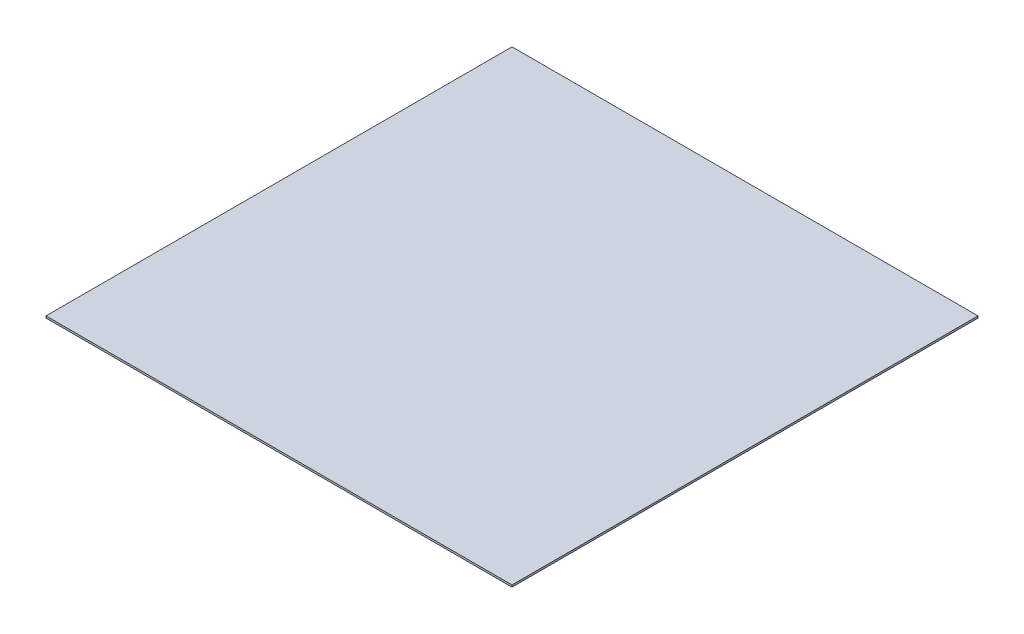
ISO-10303-21;
HEADER;
FILE_DESCRIPTION(('STEP AP214'),'2;1');
FILE_NAME('part.step','',(''),(''),'','','');
FILE_SCHEMA(('AUTOMOTIVE_DESIGN { 1 0 10303 214 1 1 1 1 }'));
ENDSEC;
DATA;
#1=APPLICATION_CONTEXT('core data for automotive mechanical design processes');
#2=APPLICATION_PROTOCOL_DEFINITION('international standard','automotive_design',2000,#1);
#3=PRODUCT_CONTEXT('',#1,'mechanical');
#4=PRODUCT('Part','Part','',(#3));
#5=PRODUCT_RELATED_PRODUCT_CATEGORY('part','',(#4));
#6=PRODUCT_DEFINITION_FORMATION('','',#4);
#7=PRODUCT_DEFINITION_CONTEXT('part definition',#1,'design');
#8=PRODUCT_DEFINITION('design','',#6,#7);
#9=PRODUCT_DEFINITION_SHAPE('','',#8);
#10=(LENGTH_UNIT() NAMED_UNIT(*) SI_UNIT(.MILLI.,.METRE.));
#11=(NAMED_UNIT(*) PLANE_ANGLE_UNIT() SI_UNIT($,.RADIAN.));
#12=(NAMED_UNIT(*) SI_UNIT($,.STERADIAN.) SOLID_ANGLE_UNIT());
#13=UNCERTAINTY_MEASURE_WITH_UNIT(LENGTH_MEASURE(1.E-05),#10,'distance_accuracy_value','');
#14=(GEOMETRIC_REPRESENTATION_CONTEXT(3) GLOBAL_UNCERTAINTY_ASSIGNED_CONTEXT((#13)) GLOBAL_UNIT_ASSIGNED_CONTEXT((#10,
#11,#12)) REPRESENTATION_CONTEXT('',''));
#15=CARTESIAN_POINT('',(0.,0.,0.));
#16=DIRECTION('',(0.,0.,1.));
#17=DIRECTION('',(1.,0.,0.));
#18=AXIS2_PLACEMENT_3D('',#15,#16,#17);
#19=CARTESIAN_POINT('',(-60.,0.5,60.));
#20=DIRECTION('',(1.,0.,0.));
#21=DIRECTION('',(0.,0.,-1.));
#22=AXIS2_PLACEMENT_3D('',#19,#20,#21);
#23=PLANE('',#22);
#24=DIRECTION('',(0.,0.,1.));
#25=VECTOR('',#24,1.);
#26=CARTESIAN_POINT('',(-60.,0.,60.));
#27=LINE('',#26,#25);
#28=CARTESIAN_POINT('',(-60.,0.,-60.));
#29=VERTEX_POINT('',#28);
#30=CARTESIAN_POINT('',(-60.,0.,60.));
#31=VERTEX_POINT('',#30);
#32=EDGE_CURVE('E94',#29,#31,#27,.T.);
#33=ORIENTED_EDGE('',*,*,#32,.T.);
#34=DIRECTION('',(0.,-1.,0.));
#35=VECTOR('',#34,1.);
#36=CARTESIAN_POINT('',(-60.,0.5,60.));
#37=LINE('',#36,#35);
#38=CARTESIAN_POINT('',(-60.,0.5,60.));
#39=VERTEX_POINT('',#38);
#40=EDGE_CURVE('E11',#39,#31,#37,.T.);
#41=ORIENTED_EDGE('',*,*,#40,.F.);
#42=DIRECTION('',(0.,0.,1.));
#43=VECTOR('',#42,1.);
#44=CARTESIAN_POINT('',(-60.,0.5,60.));
#45=LINE('',#44,#43);
#46=CARTESIAN_POINT('',(-60.,0.5,-60.));
#47=VERTEX_POINT('',#46);
#48=EDGE_CURVE('E82',#47,#39,#45,.T.);
#49=ORIENTED_EDGE('',*,*,#48,.F.);
#50=DIRECTION('',(0.,-1.,0.));
#51=VECTOR('',#50,1.);
#52=CARTESIAN_POINT('',(-60.,0.5,-60.));
#53=LINE('',#52,#51);
#54=EDGE_CURVE('E90',#47,#29,#53,.T.);
#55=ORIENTED_EDGE('',*,*,#54,.T.);
#56=EDGE_LOOP('',(#33,#41,#49,#55));
#57=FACE_BOUND('',#56,.T.);
#58=ADVANCED_FACE('F31',(#57),#23,.F.);
#59=CARTESIAN_POINT('',(60.,0.5,60.));
#60=DIRECTION('',(0.,0.,-1.));
#61=DIRECTION('',(-1.,0.,0.));
#62=AXIS2_PLACEMENT_3D('',#59,#60,#61);
#63=PLANE('',#62);
#64=DIRECTION('',(1.,0.,0.));
#65=VECTOR('',#64,1.);
#66=CARTESIAN_POINT('',(60.,0.,60.));
#67=LINE('',#66,#65);
#68=CARTESIAN_POINT('',(60.,0.,60.));
#69=VERTEX_POINT('',#68);
#70=EDGE_CURVE('E86',#31,#69,#67,.T.);
#71=ORIENTED_EDGE('',*,*,#70,.T.);
#72=DIRECTION('',(0.,-1.,0.));
#73=VECTOR('',#72,1.);
#74=CARTESIAN_POINT('',(60.,0.5,60.));
#75=LINE('',#74,#73);
#76=CARTESIAN_POINT('',(60.,0.5,60.));
#77=VERTEX_POINT('',#76);
#78=EDGE_CURVE('E39',#77,#69,#75,.T.);
#79=ORIENTED_EDGE('',*,*,#78,.F.);
#80=DIRECTION('',(1.,0.,0.));
#81=VECTOR('',#80,1.);
#82=CARTESIAN_POINT('',(60.,0.5,60.));
#83=LINE('',#82,#81);
#84=EDGE_CURVE('E77',#39,#77,#83,.T.);
#85=ORIENTED_EDGE('',*,*,#84,.F.);
#86=ORIENTED_EDGE('',*,*,#40,.T.);
#87=EDGE_LOOP('',(#71,#79,#85,#86));
#88=FACE_BOUND('',#87,.T.);
#89=ADVANCED_FACE('F85',(#88),#63,.F.);
#90=CARTESIAN_POINT('',(60.,0.5,60.));
#91=DIRECTION('',(-1.,0.,0.));
#92=DIRECTION('',(0.,0.,1.));
#93=AXIS2_PLACEMENT_3D('',#90,#91,#92);
#94=PLANE('',#93);
#95=DIRECTION('',(0.,0.,-1.));
#96=VECTOR('',#95,1.);
#97=CARTESIAN_POINT('',(60.,0.,60.));
#98=LINE('',#97,#96);
#99=CARTESIAN_POINT('',(60.,0.,-60.));
#100=VERTEX_POINT('',#99);
#101=EDGE_CURVE('E64',#69,#100,#98,.T.);
#102=ORIENTED_EDGE('',*,*,#101,.T.);
#103=DIRECTION('',(0.,-1.,0.));
#104=VECTOR('',#103,1.);
#105=CARTESIAN_POINT('',(60.,0.5,-60.));
#106=LINE('',#105,#104);
#107=CARTESIAN_POINT('',(60.,0.5,-60.));
#108=VERTEX_POINT('',#107);
#109=EDGE_CURVE('E87',#108,#100,#106,.T.);
#110=ORIENTED_EDGE('',*,*,#109,.F.);
#111=DIRECTION('',(0.,0.,-1.));
#112=VECTOR('',#111,1.);
#113=CARTESIAN_POINT('',(60.,0.5,60.));
#114=LINE('',#113,#112);
#115=EDGE_CURVE('E80',#77,#108,#114,.T.);
#116=ORIENTED_EDGE('',*,*,#115,.F.);
#117=ORIENTED_EDGE('',*,*,#78,.T.);
#118=EDGE_LOOP('',(#102,#110,#116,#117));
#119=FACE_BOUND('',#118,.T.);
#120=ADVANCED_FACE('F88',(#119),#94,.F.);
#121=CARTESIAN_POINT('',(60.,0.5,-60.));
#122=DIRECTION('',(0.,0.,1.));
#123=DIRECTION('',(1.,0.,0.));
#124=AXIS2_PLACEMENT_3D('',#121,#122,#123);
#125=PLANE('',#124);
#126=DIRECTION('',(-1.,0.,0.));
#127=VECTOR('',#126,1.);
#128=CARTESIAN_POINT('',(60.,0.,-60.));
#129=LINE('',#128,#127);
#130=EDGE_CURVE('E70',#100,#29,#129,.T.);
#131=ORIENTED_EDGE('',*,*,#130,.T.);
#132=ORIENTED_EDGE('',*,*,#54,.F.);
#133=DIRECTION('',(-1.,0.,0.));
#134=VECTOR('',#133,1.);
#135=CARTESIAN_POINT('',(60.,0.5,-60.));
#136=LINE('',#135,#134);
#137=EDGE_CURVE('E47',#108,#47,#136,.T.);
#138=ORIENTED_EDGE('',*,*,#137,.F.);
#139=ORIENTED_EDGE('',*,*,#109,.T.);
#140=EDGE_LOOP('',(#131,#132,#138,#139));
#141=FACE_BOUND('',#140,.T.);
#142=ADVANCED_FACE('F101',(#141),#125,.F.);
#143=CARTESIAN_POINT('',(-60.,0.5,-60.));
#144=DIRECTION('',(0.,1.,0.));
#145=DIRECTION('',(0.,0.,1.));
#146=AXIS2_PLACEMENT_3D('',#143,#144,#145);
#147=PLANE('',#146);
#148=ORIENTED_EDGE('',*,*,#48,.T.);
#149=ORIENTED_EDGE('',*,*,#84,.T.);
#150=ORIENTED_EDGE('',*,*,#115,.T.);
#151=ORIENTED_EDGE('',*,*,#137,.T.);
#152=EDGE_LOOP('',(#148,#149,#150,#151));
#153=FACE_BOUND('',#152,.T.);
#154=ADVANCED_FACE('F78',(#153),#147,.T.);
#155=CARTESIAN_POINT('',(-60.,0.,-60.));
#156=DIRECTION('',(0.,1.,0.));
#157=DIRECTION('',(0.,0.,1.));
#158=AXIS2_PLACEMENT_3D('',#155,#156,#157);
#159=PLANE('',#158);
#160=ORIENTED_EDGE('',*,*,#32,.F.);
#161=ORIENTED_EDGE('',*,*,#130,.F.);
#162=ORIENTED_EDGE('',*,*,#101,.F.);
#163=ORIENTED_EDGE('',*,*,#70,.F.);
#164=EDGE_LOOP('',(#160,#161,#162,#163));
#165=FACE_BOUND('',#164,.T.);
#166=ADVANCED_FACE('F104',(#165),#159,.F.);
#167=CLOSED_SHELL('',(#58,#89,#120,#142,#154,#166));
#168=MANIFOLD_SOLID_BREP('B2',#167);
#169=ADVANCED_BREP_SHAPE_REPRESENTATION('',(#18,#168),#14);
#170=SHAPE_DEFINITION_REPRESENTATION(#9,#169);
ENDSEC;
END-ISO-10303-21;
